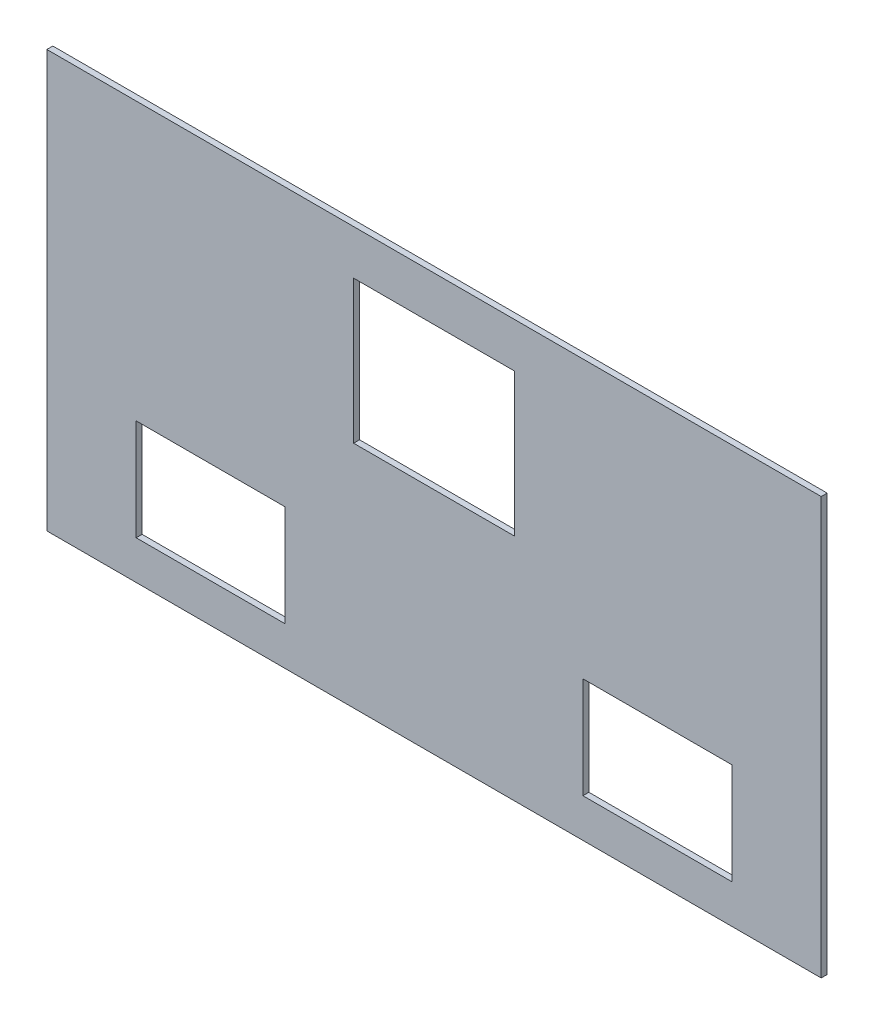
ISO-10303-21;
HEADER;
FILE_DESCRIPTION(('STEP AP214'),'2;1');
FILE_NAME('part.step','',(''),(''),'','','');
FILE_SCHEMA(('AUTOMOTIVE_DESIGN { 1 0 10303 214 1 1 1 1 }'));
ENDSEC;
DATA;
#1=APPLICATION_CONTEXT('core data for automotive mechanical design processes');
#2=APPLICATION_PROTOCOL_DEFINITION('international standard','automotive_design',2000,#1);
#3=PRODUCT_CONTEXT('',#1,'mechanical');
#4=PRODUCT('Part','Part','',(#3));
#5=PRODUCT_RELATED_PRODUCT_CATEGORY('part','',(#4));
#6=PRODUCT_DEFINITION_FORMATION('','',#4);
#7=PRODUCT_DEFINITION_CONTEXT('part definition',#1,'design');
#8=PRODUCT_DEFINITION('design','',#6,#7);
#9=PRODUCT_DEFINITION_SHAPE('','',#8);
#10=(LENGTH_UNIT() NAMED_UNIT(*) SI_UNIT(.MILLI.,.METRE.));
#11=(NAMED_UNIT(*) PLANE_ANGLE_UNIT() SI_UNIT($,.RADIAN.));
#12=(NAMED_UNIT(*) SI_UNIT($,.STERADIAN.) SOLID_ANGLE_UNIT());
#13=UNCERTAINTY_MEASURE_WITH_UNIT(LENGTH_MEASURE(1.E-05),#10,'distance_accuracy_value','');
#14=(GEOMETRIC_REPRESENTATION_CONTEXT(3) GLOBAL_UNCERTAINTY_ASSIGNED_CONTEXT((#13)) GLOBAL_UNIT_ASSIGNED_CONTEXT((#10,
#11,#12)) REPRESENTATION_CONTEXT('',''));
#15=CARTESIAN_POINT('',(0.,0.,0.));
#16=DIRECTION('',(0.,0.,1.));
#17=DIRECTION('',(1.,0.,0.));
#18=AXIS2_PLACEMENT_3D('',#15,#16,#17);
#19=CARTESIAN_POINT('',(65.,-35.,1.));
#20=DIRECTION('',(-1.,0.,0.));
#21=DIRECTION('',(0.,0.,1.));
#22=AXIS2_PLACEMENT_3D('',#19,#20,#21);
#23=PLANE('',#22);
#24=DIRECTION('',(0.,1.,0.));
#25=VECTOR('',#24,1.);
#26=CARTESIAN_POINT('',(65.,-35.,0.));
#27=LINE('',#26,#25);
#28=CARTESIAN_POINT('',(65.,-35.,0.));
#29=VERTEX_POINT('',#28);
#30=CARTESIAN_POINT('',(65.,35.,0.));
#31=VERTEX_POINT('',#30);
#32=EDGE_CURVE('E199',#29,#31,#27,.T.);
#33=ORIENTED_EDGE('',*,*,#32,.T.);
#34=DIRECTION('',(0.,0.,-1.));
#35=VECTOR('',#34,1.);
#36=CARTESIAN_POINT('',(65.,35.,1.));
#37=LINE('',#36,#35);
#38=CARTESIAN_POINT('',(65.,35.,1.));
#39=VERTEX_POINT('',#38);
#40=EDGE_CURVE('E11',#39,#31,#37,.T.);
#41=ORIENTED_EDGE('',*,*,#40,.F.);
#42=DIRECTION('',(0.,1.,0.));
#43=VECTOR('',#42,1.);
#44=CARTESIAN_POINT('',(65.,-35.,1.));
#45=LINE('',#44,#43);
#46=CARTESIAN_POINT('',(65.,-35.,1.));
#47=VERTEX_POINT('',#46);
#48=EDGE_CURVE('E290',#47,#39,#45,.T.);
#49=ORIENTED_EDGE('',*,*,#48,.F.);
#50=DIRECTION('',(0.,0.,-1.));
#51=VECTOR('',#50,1.);
#52=CARTESIAN_POINT('',(65.,-35.,1.));
#53=LINE('',#52,#51);
#54=EDGE_CURVE('E304',#47,#29,#53,.T.);
#55=ORIENTED_EDGE('',*,*,#54,.T.);
#56=EDGE_LOOP('',(#33,#41,#49,#55));
#57=FACE_BOUND('',#56,.T.);
#58=ADVANCED_FACE('F39',(#57),#23,.F.);
#59=CARTESIAN_POINT('',(-65.,35.,1.));
#60=DIRECTION('',(0.,-1.,0.));
#61=DIRECTION('',(0.,0.,-1.));
#62=AXIS2_PLACEMENT_3D('',#59,#60,#61);
#63=PLANE('',#62);
#64=DIRECTION('',(-1.,0.,0.));
#65=VECTOR('',#64,1.);
#66=CARTESIAN_POINT('',(-65.,35.,0.));
#67=LINE('',#66,#65);
#68=CARTESIAN_POINT('',(-65.,35.,0.));
#69=VERTEX_POINT('',#68);
#70=EDGE_CURVE('E308',#31,#69,#67,.T.);
#71=ORIENTED_EDGE('',*,*,#70,.T.);
#72=DIRECTION('',(0.,0.,-1.));
#73=VECTOR('',#72,1.);
#74=CARTESIAN_POINT('',(-65.,35.,1.));
#75=LINE('',#74,#73);
#76=CARTESIAN_POINT('',(-65.,35.,1.));
#77=VERTEX_POINT('',#76);
#78=EDGE_CURVE('E47',#77,#69,#75,.T.);
#79=ORIENTED_EDGE('',*,*,#78,.F.);
#80=DIRECTION('',(-1.,0.,0.));
#81=VECTOR('',#80,1.);
#82=CARTESIAN_POINT('',(-65.,35.,1.));
#83=LINE('',#82,#81);
#84=EDGE_CURVE('E294',#39,#77,#83,.T.);
#85=ORIENTED_EDGE('',*,*,#84,.F.);
#86=ORIENTED_EDGE('',*,*,#40,.T.);
#87=EDGE_LOOP('',(#71,#79,#85,#86));
#88=FACE_BOUND('',#87,.T.);
#89=ADVANCED_FACE('F343',(#88),#63,.F.);
#90=CARTESIAN_POINT('',(-65.,-35.,1.));
#91=DIRECTION('',(1.,0.,0.));
#92=DIRECTION('',(0.,0.,-1.));
#93=AXIS2_PLACEMENT_3D('',#90,#91,#92);
#94=PLANE('',#93);
#95=DIRECTION('',(0.,-1.,0.));
#96=VECTOR('',#95,1.);
#97=CARTESIAN_POINT('',(-65.,-35.,0.));
#98=LINE('',#97,#96);
#99=CARTESIAN_POINT('',(-65.,-35.,0.));
#100=VERTEX_POINT('',#99);
#101=EDGE_CURVE('E311',#69,#100,#98,.T.);
#102=ORIENTED_EDGE('',*,*,#101,.T.);
#103=DIRECTION('',(0.,0.,-1.));
#104=VECTOR('',#103,1.);
#105=CARTESIAN_POINT('',(-65.,-35.,1.));
#106=LINE('',#105,#104);
#107=CARTESIAN_POINT('',(-65.,-35.,1.));
#108=VERTEX_POINT('',#107);
#109=EDGE_CURVE('E319',#108,#100,#106,.T.);
#110=ORIENTED_EDGE('',*,*,#109,.F.);
#111=DIRECTION('',(0.,-1.,0.));
#112=VECTOR('',#111,1.);
#113=CARTESIAN_POINT('',(-65.,-35.,1.));
#114=LINE('',#113,#112);
#115=EDGE_CURVE('E298',#77,#108,#114,.T.);
#116=ORIENTED_EDGE('',*,*,#115,.F.);
#117=ORIENTED_EDGE('',*,*,#78,.T.);
#118=EDGE_LOOP('',(#102,#110,#116,#117));
#119=FACE_BOUND('',#118,.T.);
#120=ADVANCED_FACE('F328',(#119),#94,.F.);
#121=CARTESIAN_POINT('',(-65.,-35.,1.));
#122=DIRECTION('',(0.,1.,0.));
#123=DIRECTION('',(0.,0.,1.));
#124=AXIS2_PLACEMENT_3D('',#121,#122,#123);
#125=PLANE('',#124);
#126=DIRECTION('',(1.,0.,0.));
#127=VECTOR('',#126,1.);
#128=CARTESIAN_POINT('',(-65.,-35.,0.));
#129=LINE('',#128,#127);
#130=EDGE_CURVE('E295',#100,#29,#129,.T.);
#131=ORIENTED_EDGE('',*,*,#130,.T.);
#132=ORIENTED_EDGE('',*,*,#54,.F.);
#133=DIRECTION('',(1.,0.,0.));
#134=VECTOR('',#133,1.);
#135=CARTESIAN_POINT('',(-65.,-35.,1.));
#136=LINE('',#135,#134);
#137=EDGE_CURVE('E301',#108,#47,#136,.T.);
#138=ORIENTED_EDGE('',*,*,#137,.F.);
#139=ORIENTED_EDGE('',*,*,#109,.T.);
#140=EDGE_LOOP('',(#131,#132,#138,#139));
#141=FACE_BOUND('',#140,.T.);
#142=ADVANCED_FACE('F336',(#141),#125,.F.);
#143=CARTESIAN_POINT('',(0.,0.,1.));
#144=DIRECTION('',(0.,0.,-1.));
#145=DIRECTION('',(-1.,0.,0.));
#146=AXIS2_PLACEMENT_3D('',#143,#144,#145);
#147=PLANE('',#146);
#148=DIRECTION('',(-1.,0.,0.));
#149=VECTOR('',#148,1.);
#150=CARTESIAN_POINT('',(-50.,-11.5,1.));
#151=LINE('',#150,#149);
#152=CARTESIAN_POINT('',(-25.,-11.5,1.));
#153=VERTEX_POINT('',#152);
#154=CARTESIAN_POINT('',(-50.,-11.5,1.));
#155=VERTEX_POINT('',#154);
#156=EDGE_CURVE('E189',#153,#155,#151,.T.);
#157=ORIENTED_EDGE('',*,*,#156,.F.);
#158=DIRECTION('',(0.,1.,0.));
#159=VECTOR('',#158,1.);
#160=CARTESIAN_POINT('',(-25.,-28.5,1.));
#161=LINE('',#160,#159);
#162=CARTESIAN_POINT('',(-25.,-28.5,1.));
#163=VERTEX_POINT('',#162);
#164=EDGE_CURVE('E54',#163,#153,#161,.T.);
#165=ORIENTED_EDGE('',*,*,#164,.F.);
#166=DIRECTION('',(1.,0.,0.));
#167=VECTOR('',#166,1.);
#168=CARTESIAN_POINT('',(-50.,-28.5,1.));
#169=LINE('',#168,#167);
#170=CARTESIAN_POINT('',(-50.,-28.5,1.));
#171=VERTEX_POINT('',#170);
#172=EDGE_CURVE('E176',#171,#163,#169,.T.);
#173=ORIENTED_EDGE('',*,*,#172,.F.);
#174=DIRECTION('',(0.,-1.,0.));
#175=VECTOR('',#174,1.);
#176=CARTESIAN_POINT('',(-50.,-28.5,1.));
#177=LINE('',#176,#175);
#178=EDGE_CURVE('E180',#155,#171,#177,.T.);
#179=ORIENTED_EDGE('',*,*,#178,.F.);
#180=EDGE_LOOP('',(#157,#165,#173,#179));
#181=FACE_BOUND('',#180,.T.);
#182=DIRECTION('',(-1.,0.,0.));
#183=VECTOR('',#182,1.);
#184=CARTESIAN_POINT('',(25.,-11.5,1.));
#185=LINE('',#184,#183);
#186=CARTESIAN_POINT('',(50.,-11.5,1.));
#187=VERTEX_POINT('',#186);
#188=CARTESIAN_POINT('',(25.,-11.5,1.));
#189=VERTEX_POINT('',#188);
#190=EDGE_CURVE('E225',#187,#189,#185,.T.);
#191=ORIENTED_EDGE('',*,*,#190,.F.);
#192=DIRECTION('',(0.,1.,0.));
#193=VECTOR('',#192,1.);
#194=CARTESIAN_POINT('',(50.,-28.5,1.));
#195=LINE('',#194,#193);
#196=CARTESIAN_POINT('',(50.,-28.5,1.));
#197=VERTEX_POINT('',#196);
#198=EDGE_CURVE('E62',#197,#187,#195,.T.);
#199=ORIENTED_EDGE('',*,*,#198,.F.);
#200=DIRECTION('',(1.,0.,0.));
#201=VECTOR('',#200,1.);
#202=CARTESIAN_POINT('',(25.,-28.5,1.));
#203=LINE('',#202,#201);
#204=CARTESIAN_POINT('',(25.,-28.5,1.));
#205=VERTEX_POINT('',#204);
#206=EDGE_CURVE('E210',#205,#197,#203,.T.);
#207=ORIENTED_EDGE('',*,*,#206,.F.);
#208=DIRECTION('',(0.,-1.,0.));
#209=VECTOR('',#208,1.);
#210=CARTESIAN_POINT('',(25.,-28.5,1.));
#211=LINE('',#210,#209);
#212=EDGE_CURVE('E230',#189,#205,#211,.T.);
#213=ORIENTED_EDGE('',*,*,#212,.F.);
#214=EDGE_LOOP('',(#191,#199,#207,#213));
#215=FACE_BOUND('',#214,.T.);
#216=DIRECTION('',(-1.,0.,0.));
#217=VECTOR('',#216,1.);
#218=CARTESIAN_POINT('',(-13.5,27.5,1.));
#219=LINE('',#218,#217);
#220=CARTESIAN_POINT('',(13.5,27.5,1.));
#221=VERTEX_POINT('',#220);
#222=CARTESIAN_POINT('',(-13.5,27.5,1.));
#223=VERTEX_POINT('',#222);
#224=EDGE_CURVE('E268',#221,#223,#219,.T.);
#225=ORIENTED_EDGE('',*,*,#224,.F.);
#226=DIRECTION('',(0.,1.,0.));
#227=VECTOR('',#226,1.);
#228=CARTESIAN_POINT('',(13.5,3.50000000000001,1.));
#229=LINE('',#228,#227);
#230=CARTESIAN_POINT('',(13.5,3.50000000000001,1.));
#231=VERTEX_POINT('',#230);
#232=EDGE_CURVE('E265',#231,#221,#229,.T.);
#233=ORIENTED_EDGE('',*,*,#232,.F.);
#234=DIRECTION('',(1.,0.,0.));
#235=VECTOR('',#234,1.);
#236=CARTESIAN_POINT('',(-13.5,3.50000000000001,1.));
#237=LINE('',#236,#235);
#238=CARTESIAN_POINT('',(-13.5,3.50000000000001,1.));
#239=VERTEX_POINT('',#238);
#240=EDGE_CURVE('E252',#239,#231,#237,.T.);
#241=ORIENTED_EDGE('',*,*,#240,.F.);
#242=DIRECTION('',(0.,-1.,0.));
#243=VECTOR('',#242,1.);
#244=CARTESIAN_POINT('',(-13.5,3.50000000000001,1.));
#245=LINE('',#244,#243);
#246=EDGE_CURVE('E272',#223,#239,#245,.T.);
#247=ORIENTED_EDGE('',*,*,#246,.F.);
#248=EDGE_LOOP('',(#225,#233,#241,#247));
#249=FACE_BOUND('',#248,.T.);
#250=ORIENTED_EDGE('',*,*,#48,.T.);
#251=ORIENTED_EDGE('',*,*,#84,.T.);
#252=ORIENTED_EDGE('',*,*,#115,.T.);
#253=ORIENTED_EDGE('',*,*,#137,.T.);
#254=EDGE_LOOP('',(#250,#251,#252,#253));
#255=FACE_BOUND('',#254,.T.);
#256=ADVANCED_FACE('F342',(#181,#215,#249,#255),#147,.F.);
#257=CARTESIAN_POINT('',(0.,0.,0.));
#258=DIRECTION('',(0.,0.,-1.));
#259=DIRECTION('',(-1.,0.,0.));
#260=AXIS2_PLACEMENT_3D('',#257,#258,#259);
#261=PLANE('',#260);
#262=DIRECTION('',(0.,1.,0.));
#263=VECTOR('',#262,1.);
#264=CARTESIAN_POINT('',(-25.,-28.5,0.));
#265=LINE('',#264,#263);
#266=CARTESIAN_POINT('',(-25.,-28.5,0.));
#267=VERTEX_POINT('',#266);
#268=CARTESIAN_POINT('',(-25.,-11.5,0.));
#269=VERTEX_POINT('',#268);
#270=EDGE_CURVE('E154',#267,#269,#265,.T.);
#271=ORIENTED_EDGE('',*,*,#270,.T.);
#272=DIRECTION('',(-1.,0.,0.));
#273=VECTOR('',#272,1.);
#274=CARTESIAN_POINT('',(-50.,-11.5,0.));
#275=LINE('',#274,#273);
#276=CARTESIAN_POINT('',(-50.,-11.5,0.));
#277=VERTEX_POINT('',#276);
#278=EDGE_CURVE('E165',#269,#277,#275,.T.);
#279=ORIENTED_EDGE('',*,*,#278,.T.);
#280=DIRECTION('',(0.,-1.,0.));
#281=VECTOR('',#280,1.);
#282=CARTESIAN_POINT('',(-50.,-28.5,0.));
#283=LINE('',#282,#281);
#284=CARTESIAN_POINT('',(-50.,-28.5,0.));
#285=VERTEX_POINT('',#284);
#286=EDGE_CURVE('E170',#277,#285,#283,.T.);
#287=ORIENTED_EDGE('',*,*,#286,.T.);
#288=DIRECTION('',(1.,0.,0.));
#289=VECTOR('',#288,1.);
#290=CARTESIAN_POINT('',(-50.,-28.5,0.));
#291=LINE('',#290,#289);
#292=EDGE_CURVE('E161',#285,#267,#291,.T.);
#293=ORIENTED_EDGE('',*,*,#292,.T.);
#294=EDGE_LOOP('',(#271,#279,#287,#293));
#295=FACE_BOUND('',#294,.T.);
#296=DIRECTION('',(0.,1.,0.));
#297=VECTOR('',#296,1.);
#298=CARTESIAN_POINT('',(50.,-28.5,0.));
#299=LINE('',#298,#297);
#300=CARTESIAN_POINT('',(50.,-28.5,0.));
#301=VERTEX_POINT('',#300);
#302=CARTESIAN_POINT('',(50.,-11.5,0.));
#303=VERTEX_POINT('',#302);
#304=EDGE_CURVE('E205',#301,#303,#299,.T.);
#305=ORIENTED_EDGE('',*,*,#304,.T.);
#306=DIRECTION('',(-1.,0.,0.));
#307=VECTOR('',#306,1.);
#308=CARTESIAN_POINT('',(25.,-11.5,0.));
#309=LINE('',#308,#307);
#310=CARTESIAN_POINT('',(25.,-11.5,0.));
#311=VERTEX_POINT('',#310);
#312=EDGE_CURVE('E209',#303,#311,#309,.T.);
#313=ORIENTED_EDGE('',*,*,#312,.T.);
#314=DIRECTION('',(0.,-1.,0.));
#315=VECTOR('',#314,1.);
#316=CARTESIAN_POINT('',(25.,-28.5,0.));
#317=LINE('',#316,#315);
#318=CARTESIAN_POINT('',(25.,-28.5,0.));
#319=VERTEX_POINT('',#318);
#320=EDGE_CURVE('E214',#311,#319,#317,.T.);
#321=ORIENTED_EDGE('',*,*,#320,.T.);
#322=DIRECTION('',(1.,0.,0.));
#323=VECTOR('',#322,1.);
#324=CARTESIAN_POINT('',(25.,-28.5,0.));
#325=LINE('',#324,#323);
#326=EDGE_CURVE('E218',#319,#301,#325,.T.);
#327=ORIENTED_EDGE('',*,*,#326,.T.);
#328=EDGE_LOOP('',(#305,#313,#321,#327));
#329=FACE_BOUND('',#328,.T.);
#330=DIRECTION('',(0.,1.,0.));
#331=VECTOR('',#330,1.);
#332=CARTESIAN_POINT('',(13.5,3.50000000000001,0.));
#333=LINE('',#332,#331);
#334=CARTESIAN_POINT('',(13.5,3.50000000000001,0.));
#335=VERTEX_POINT('',#334);
#336=CARTESIAN_POINT('',(13.5,27.5,0.));
#337=VERTEX_POINT('',#336);
#338=EDGE_CURVE('E247',#335,#337,#333,.T.);
#339=ORIENTED_EDGE('',*,*,#338,.T.);
#340=DIRECTION('',(-1.,0.,0.));
#341=VECTOR('',#340,1.);
#342=CARTESIAN_POINT('',(-13.5,27.5,0.));
#343=LINE('',#342,#341);
#344=CARTESIAN_POINT('',(-13.5,27.5,0.));
#345=VERTEX_POINT('',#344);
#346=EDGE_CURVE('E251',#337,#345,#343,.T.);
#347=ORIENTED_EDGE('',*,*,#346,.T.);
#348=DIRECTION('',(0.,-1.,0.));
#349=VECTOR('',#348,1.);
#350=CARTESIAN_POINT('',(-13.5,3.50000000000001,0.));
#351=LINE('',#350,#349);
#352=CARTESIAN_POINT('',(-13.5,3.50000000000001,0.));
#353=VERTEX_POINT('',#352);
#354=EDGE_CURVE('E256',#345,#353,#351,.T.);
#355=ORIENTED_EDGE('',*,*,#354,.T.);
#356=DIRECTION('',(1.,0.,0.));
#357=VECTOR('',#356,1.);
#358=CARTESIAN_POINT('',(-13.5,3.50000000000001,0.));
#359=LINE('',#358,#357);
#360=EDGE_CURVE('E260',#353,#335,#359,.T.);
#361=ORIENTED_EDGE('',*,*,#360,.T.);
#362=EDGE_LOOP('',(#339,#347,#355,#361));
#363=FACE_BOUND('',#362,.T.);
#364=ORIENTED_EDGE('',*,*,#32,.F.);
#365=ORIENTED_EDGE('',*,*,#130,.F.);
#366=ORIENTED_EDGE('',*,*,#101,.F.);
#367=ORIENTED_EDGE('',*,*,#70,.F.);
#368=EDGE_LOOP('',(#364,#365,#366,#367));
#369=FACE_BOUND('',#368,.T.);
#370=ADVANCED_FACE('F172',(#295,#329,#363,#369),#261,.T.);
#371=CARTESIAN_POINT('',(13.5,3.50000000000001,0.));
#372=DIRECTION('',(1.,0.,0.));
#373=DIRECTION('',(0.,0.,-1.));
#374=AXIS2_PLACEMENT_3D('',#371,#372,#373);
#375=PLANE('',#374);
#376=ORIENTED_EDGE('',*,*,#232,.T.);
#377=DIRECTION('',(0.,0.,1.));
#378=VECTOR('',#377,1.);
#379=CARTESIAN_POINT('',(13.5,27.5,0.));
#380=LINE('',#379,#378);
#381=EDGE_CURVE('E264',#337,#221,#380,.T.);
#382=ORIENTED_EDGE('',*,*,#381,.F.);
#383=ORIENTED_EDGE('',*,*,#338,.F.);
#384=DIRECTION('',(0.,0.,1.));
#385=VECTOR('',#384,1.);
#386=CARTESIAN_POINT('',(13.5,3.50000000000001,0.));
#387=LINE('',#386,#385);
#388=EDGE_CURVE('E226',#335,#231,#387,.T.);
#389=ORIENTED_EDGE('',*,*,#388,.T.);
#390=EDGE_LOOP('',(#376,#382,#383,#389));
#391=FACE_BOUND('',#390,.T.);
#392=ADVANCED_FACE('F355',(#391),#375,.F.);
#393=CARTESIAN_POINT('',(-13.5,3.50000000000001,0.));
#394=DIRECTION('',(0.,-1.,0.));
#395=DIRECTION('',(0.,0.,-1.));
#396=AXIS2_PLACEMENT_3D('',#393,#394,#395);
#397=PLANE('',#396);
#398=ORIENTED_EDGE('',*,*,#240,.T.);
#399=ORIENTED_EDGE('',*,*,#388,.F.);
#400=ORIENTED_EDGE('',*,*,#360,.F.);
#401=DIRECTION('',(0.,0.,1.));
#402=VECTOR('',#401,1.);
#403=CARTESIAN_POINT('',(-13.5,3.50000000000001,0.));
#404=LINE('',#403,#402);
#405=EDGE_CURVE('E281',#353,#239,#404,.T.);
#406=ORIENTED_EDGE('',*,*,#405,.T.);
#407=EDGE_LOOP('',(#398,#399,#400,#406));
#408=FACE_BOUND('',#407,.T.);
#409=ADVANCED_FACE('F361',(#408),#397,.F.);
#410=CARTESIAN_POINT('',(-13.5,3.50000000000001,0.));
#411=DIRECTION('',(-1.,0.,0.));
#412=DIRECTION('',(0.,0.,1.));
#413=AXIS2_PLACEMENT_3D('',#410,#411,#412);
#414=PLANE('',#413);
#415=ORIENTED_EDGE('',*,*,#246,.T.);
#416=ORIENTED_EDGE('',*,*,#405,.F.);
#417=ORIENTED_EDGE('',*,*,#354,.F.);
#418=DIRECTION('',(0.,0.,1.));
#419=VECTOR('',#418,1.);
#420=CARTESIAN_POINT('',(-13.5,27.5,0.));
#421=LINE('',#420,#419);
#422=EDGE_CURVE('E284',#345,#223,#421,.T.);
#423=ORIENTED_EDGE('',*,*,#422,.T.);
#424=EDGE_LOOP('',(#415,#416,#417,#423));
#425=FACE_BOUND('',#424,.T.);
#426=ADVANCED_FACE('F367',(#425),#414,.F.);
#427=CARTESIAN_POINT('',(-13.5,27.5,0.));
#428=DIRECTION('',(0.,1.,0.));
#429=DIRECTION('',(0.,0.,1.));
#430=AXIS2_PLACEMENT_3D('',#427,#428,#429);
#431=PLANE('',#430);
#432=ORIENTED_EDGE('',*,*,#224,.T.);
#433=ORIENTED_EDGE('',*,*,#422,.F.);
#434=ORIENTED_EDGE('',*,*,#346,.F.);
#435=ORIENTED_EDGE('',*,*,#381,.T.);
#436=EDGE_LOOP('',(#432,#433,#434,#435));
#437=FACE_BOUND('',#436,.T.);
#438=ADVANCED_FACE('F363',(#437),#431,.F.);
#439=CARTESIAN_POINT('',(50.,-28.5,0.));
#440=DIRECTION('',(1.,0.,0.));
#441=DIRECTION('',(0.,0.,-1.));
#442=AXIS2_PLACEMENT_3D('',#439,#440,#441);
#443=PLANE('',#442);
#444=ORIENTED_EDGE('',*,*,#198,.T.);
#445=DIRECTION('',(0.,0.,1.));
#446=VECTOR('',#445,1.);
#447=CARTESIAN_POINT('',(50.,-11.5,0.));
#448=LINE('',#447,#446);
#449=EDGE_CURVE('E222',#303,#187,#448,.T.);
#450=ORIENTED_EDGE('',*,*,#449,.F.);
#451=ORIENTED_EDGE('',*,*,#304,.F.);
#452=DIRECTION('',(0.,0.,1.));
#453=VECTOR('',#452,1.);
#454=CARTESIAN_POINT('',(50.,-28.5,0.));
#455=LINE('',#454,#453);
#456=EDGE_CURVE('E190',#301,#197,#455,.T.);
#457=ORIENTED_EDGE('',*,*,#456,.T.);
#458=EDGE_LOOP('',(#444,#450,#451,#457));
#459=FACE_BOUND('',#458,.T.);
#460=ADVANCED_FACE('F366',(#459),#443,.F.);
#461=CARTESIAN_POINT('',(25.,-28.5,0.));
#462=DIRECTION('',(0.,-1.,0.));
#463=DIRECTION('',(0.,0.,-1.));
#464=AXIS2_PLACEMENT_3D('',#461,#462,#463);
#465=PLANE('',#464);
#466=ORIENTED_EDGE('',*,*,#206,.T.);
#467=ORIENTED_EDGE('',*,*,#456,.F.);
#468=ORIENTED_EDGE('',*,*,#326,.F.);
#469=DIRECTION('',(0.,0.,1.));
#470=VECTOR('',#469,1.);
#471=CARTESIAN_POINT('',(25.,-28.5,0.));
#472=LINE('',#471,#470);
#473=EDGE_CURVE('E239',#319,#205,#472,.T.);
#474=ORIENTED_EDGE('',*,*,#473,.T.);
#475=EDGE_LOOP('',(#466,#467,#468,#474));
#476=FACE_BOUND('',#475,.T.);
#477=ADVANCED_FACE('F377',(#476),#465,.F.);
#478=CARTESIAN_POINT('',(25.,-28.5,0.));
#479=DIRECTION('',(-1.,0.,0.));
#480=DIRECTION('',(0.,0.,1.));
#481=AXIS2_PLACEMENT_3D('',#478,#479,#480);
#482=PLANE('',#481);
#483=ORIENTED_EDGE('',*,*,#212,.T.);
#484=ORIENTED_EDGE('',*,*,#473,.F.);
#485=ORIENTED_EDGE('',*,*,#320,.F.);
#486=DIRECTION('',(0.,0.,1.));
#487=VECTOR('',#486,1.);
#488=CARTESIAN_POINT('',(25.,-11.5,0.));
#489=LINE('',#488,#487);
#490=EDGE_CURVE('E242',#311,#189,#489,.T.);
#491=ORIENTED_EDGE('',*,*,#490,.T.);
#492=EDGE_LOOP('',(#483,#484,#485,#491));
#493=FACE_BOUND('',#492,.T.);
#494=ADVANCED_FACE('F381',(#493),#482,.F.);
#495=CARTESIAN_POINT('',(25.,-11.5,0.));
#496=DIRECTION('',(0.,1.,0.));
#497=DIRECTION('',(0.,0.,1.));
#498=AXIS2_PLACEMENT_3D('',#495,#496,#497);
#499=PLANE('',#498);
#500=ORIENTED_EDGE('',*,*,#190,.T.);
#501=ORIENTED_EDGE('',*,*,#490,.F.);
#502=ORIENTED_EDGE('',*,*,#312,.F.);
#503=ORIENTED_EDGE('',*,*,#449,.T.);
#504=EDGE_LOOP('',(#500,#501,#502,#503));
#505=FACE_BOUND('',#504,.T.);
#506=ADVANCED_FACE('F378',(#505),#499,.F.);
#507=CARTESIAN_POINT('',(-25.,-28.5,0.));
#508=DIRECTION('',(1.,0.,0.));
#509=DIRECTION('',(0.,1.,0.));
#510=AXIS2_PLACEMENT_3D('',#507,#508,#509);
#511=PLANE('',#510);
#512=ORIENTED_EDGE('',*,*,#164,.T.);
#513=DIRECTION('',(0.,0.,1.));
#514=VECTOR('',#513,1.);
#515=CARTESIAN_POINT('',(-25.,-11.5,0.));
#516=LINE('',#515,#514);
#517=EDGE_CURVE('E150',#269,#153,#516,.T.);
#518=ORIENTED_EDGE('',*,*,#517,.F.);
#519=ORIENTED_EDGE('',*,*,#270,.F.);
#520=DIRECTION('',(0.,0.,1.));
#521=VECTOR('',#520,1.);
#522=CARTESIAN_POINT('',(-25.,-28.5,0.));
#523=LINE('',#522,#521);
#524=EDGE_CURVE('E196',#267,#163,#523,.T.);
#525=ORIENTED_EDGE('',*,*,#524,.T.);
#526=EDGE_LOOP('',(#512,#518,#519,#525));
#527=FACE_BOUND('',#526,.T.);
#528=ADVANCED_FACE('F152',(#527),#511,.F.);
#529=CARTESIAN_POINT('',(-50.,-28.5,0.));
#530=DIRECTION('',(0.,-1.,0.));
#531=DIRECTION('',(0.,0.,-1.));
#532=AXIS2_PLACEMENT_3D('',#529,#530,#531);
#533=PLANE('',#532);
#534=ORIENTED_EDGE('',*,*,#172,.T.);
#535=ORIENTED_EDGE('',*,*,#524,.F.);
#536=ORIENTED_EDGE('',*,*,#292,.F.);
#537=DIRECTION('',(0.,0.,1.));
#538=VECTOR('',#537,1.);
#539=CARTESIAN_POINT('',(-50.,-28.5,0.));
#540=LINE('',#539,#538);
#541=EDGE_CURVE('E200',#285,#171,#540,.T.);
#542=ORIENTED_EDGE('',*,*,#541,.T.);
#543=EDGE_LOOP('',(#534,#535,#536,#542));
#544=FACE_BOUND('',#543,.T.);
#545=ADVANCED_FACE('F391',(#544),#533,.F.);
#546=CARTESIAN_POINT('',(-50.,-28.5,0.));
#547=DIRECTION('',(-1.,0.,0.));
#548=DIRECTION('',(0.,0.,1.));
#549=AXIS2_PLACEMENT_3D('',#546,#547,#548);
#550=PLANE('',#549);
#551=ORIENTED_EDGE('',*,*,#178,.T.);
#552=ORIENTED_EDGE('',*,*,#541,.F.);
#553=ORIENTED_EDGE('',*,*,#286,.F.);
#554=DIRECTION('',(0.,0.,1.));
#555=VECTOR('',#554,1.);
#556=CARTESIAN_POINT('',(-50.,-11.5,0.));
#557=LINE('',#556,#555);
#558=EDGE_CURVE('E160',#277,#155,#557,.T.);
#559=ORIENTED_EDGE('',*,*,#558,.T.);
#560=EDGE_LOOP('',(#551,#552,#553,#559));
#561=FACE_BOUND('',#560,.T.);
#562=ADVANCED_FACE('F394',(#561),#550,.F.);
#563=CARTESIAN_POINT('',(-50.,-11.5,0.));
#564=DIRECTION('',(0.,1.,0.));
#565=DIRECTION('',(-1.,0.,0.));
#566=AXIS2_PLACEMENT_3D('',#563,#564,#565);
#567=PLANE('',#566);
#568=ORIENTED_EDGE('',*,*,#156,.T.);
#569=ORIENTED_EDGE('',*,*,#558,.F.);
#570=ORIENTED_EDGE('',*,*,#278,.F.);
#571=ORIENTED_EDGE('',*,*,#517,.T.);
#572=EDGE_LOOP('',(#568,#569,#570,#571));
#573=FACE_BOUND('',#572,.T.);
#574=ADVANCED_FACE('F166',(#573),#567,.F.);
#575=CLOSED_SHELL('',(#58,#89,#120,#142,#256,#370,#392,#409,#426,#438,#460,#477,#494,#506,#528,
#545,#562,#574));
#576=MANIFOLD_SOLID_BREP('B2',#575);
#577=ADVANCED_BREP_SHAPE_REPRESENTATION('',(#18,#576),#14);
#578=SHAPE_DEFINITION_REPRESENTATION(#9,#577);
ENDSEC;
END-ISO-10303-21;
